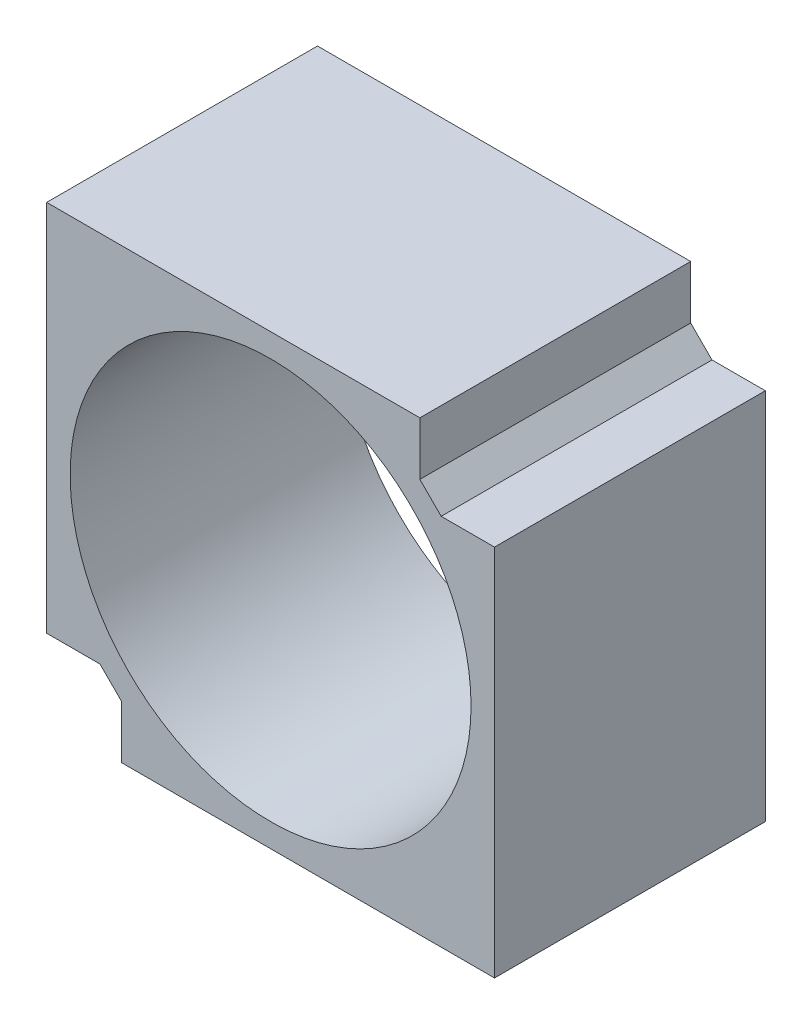
ISO-10303-21;
HEADER;
FILE_DESCRIPTION(('STEP AP214'),'2;1');
FILE_NAME('part.step','',(''),(''),'','','');
FILE_SCHEMA(('AUTOMOTIVE_DESIGN { 1 0 10303 214 1 1 1 1 }'));
ENDSEC;
DATA;
#1=APPLICATION_CONTEXT('core data for automotive mechanical design processes');
#2=APPLICATION_PROTOCOL_DEFINITION('international standard','automotive_design',2000,#1);
#3=PRODUCT_CONTEXT('',#1,'mechanical');
#4=PRODUCT('Part','Part','',(#3));
#5=PRODUCT_RELATED_PRODUCT_CATEGORY('part','',(#4));
#6=PRODUCT_DEFINITION_FORMATION('','',#4);
#7=PRODUCT_DEFINITION_CONTEXT('part definition',#1,'design');
#8=PRODUCT_DEFINITION('design','',#6,#7);
#9=PRODUCT_DEFINITION_SHAPE('','',#8);
#10=(LENGTH_UNIT() NAMED_UNIT(*) SI_UNIT(.MILLI.,.METRE.));
#11=(NAMED_UNIT(*) PLANE_ANGLE_UNIT() SI_UNIT($,.RADIAN.));
#12=(NAMED_UNIT(*) SI_UNIT($,.STERADIAN.) SOLID_ANGLE_UNIT());
#13=UNCERTAINTY_MEASURE_WITH_UNIT(LENGTH_MEASURE(1.E-05),#10,'distance_accuracy_value','');
#14=(GEOMETRIC_REPRESENTATION_CONTEXT(3) GLOBAL_UNCERTAINTY_ASSIGNED_CONTEXT((#13)) GLOBAL_UNIT_ASSIGNED_CONTEXT((#10,
#11,#12)) REPRESENTATION_CONTEXT('',''));
#15=CARTESIAN_POINT('',(0.,0.,0.));
#16=DIRECTION('',(0.,0.,1.));
#17=DIRECTION('',(1.,0.,0.));
#18=AXIS2_PLACEMENT_3D('',#15,#16,#17);
#19=CARTESIAN_POINT('',(-21.,-21.,25.4));
#20=DIRECTION('',(1.,0.,0.));
#21=DIRECTION('',(0.,0.,-1.));
#22=AXIS2_PLACEMENT_3D('',#19,#20,#21);
#23=PLANE('',#22);
#24=DIRECTION('',(0.,-1.,0.));
#25=VECTOR('',#24,1.);
#26=CARTESIAN_POINT('',(-21.,-21.,0.));
#27=LINE('',#26,#25);
#28=CARTESIAN_POINT('',(-21.,21.,0.));
#29=VERTEX_POINT('',#28);
#30=CARTESIAN_POINT('',(-21.,-14.,0.));
#31=VERTEX_POINT('',#30);
#32=EDGE_CURVE('E141',#29,#31,#27,.T.);
#33=ORIENTED_EDGE('',*,*,#32,.T.);
#34=DIRECTION('',(0.,0.,1.));
#35=VECTOR('',#34,1.);
#36=CARTESIAN_POINT('',(-21.,-14.,0.));
#37=LINE('',#36,#35);
#38=CARTESIAN_POINT('',(-21.,-14.,25.4));
#39=VERTEX_POINT('',#38);
#40=EDGE_CURVE('E181',#31,#39,#37,.T.);
#41=ORIENTED_EDGE('',*,*,#40,.T.);
#42=DIRECTION('',(0.,-1.,0.));
#43=VECTOR('',#42,1.);
#44=CARTESIAN_POINT('',(-21.,-21.,25.4));
#45=LINE('',#44,#43);
#46=CARTESIAN_POINT('',(-21.,21.,25.4));
#47=VERTEX_POINT('',#46);
#48=EDGE_CURVE('E157',#47,#39,#45,.T.);
#49=ORIENTED_EDGE('',*,*,#48,.F.);
#50=DIRECTION('',(0.,0.,-1.));
#51=VECTOR('',#50,1.);
#52=CARTESIAN_POINT('',(-21.,21.,25.4));
#53=LINE('',#52,#51);
#54=EDGE_CURVE('E11',#47,#29,#53,.T.);
#55=ORIENTED_EDGE('',*,*,#54,.T.);
#56=EDGE_LOOP('',(#33,#41,#49,#55));
#57=FACE_BOUND('',#56,.T.);
#58=ADVANCED_FACE('F40',(#57),#23,.F.);
#59=CARTESIAN_POINT('',(21.,-21.,25.4));
#60=DIRECTION('',(0.,1.,0.));
#61=DIRECTION('',(-1.,0.,0.));
#62=AXIS2_PLACEMENT_3D('',#59,#60,#61);
#63=PLANE('',#62);
#64=DIRECTION('',(1.,0.,0.));
#65=VECTOR('',#64,1.);
#66=CARTESIAN_POINT('',(21.,-21.,25.4));
#67=LINE('',#66,#65);
#68=CARTESIAN_POINT('',(-14.,-21.,25.4));
#69=VERTEX_POINT('',#68);
#70=CARTESIAN_POINT('',(21.,-21.,25.4));
#71=VERTEX_POINT('',#70);
#72=EDGE_CURVE('E132',#69,#71,#67,.T.);
#73=ORIENTED_EDGE('',*,*,#72,.F.);
#74=DIRECTION('',(0.,0.,1.));
#75=VECTOR('',#74,1.);
#76=CARTESIAN_POINT('',(-14.,-21.,0.));
#77=LINE('',#76,#75);
#78=CARTESIAN_POINT('',(-14.,-21.,0.));
#79=VERTEX_POINT('',#78);
#80=EDGE_CURVE('E119',#79,#69,#77,.T.);
#81=ORIENTED_EDGE('',*,*,#80,.F.);
#82=DIRECTION('',(1.,0.,0.));
#83=VECTOR('',#82,1.);
#84=CARTESIAN_POINT('',(21.,-21.,0.));
#85=LINE('',#84,#83);
#86=CARTESIAN_POINT('',(21.,-21.,0.));
#87=VERTEX_POINT('',#86);
#88=EDGE_CURVE('E130',#79,#87,#85,.T.);
#89=ORIENTED_EDGE('',*,*,#88,.T.);
#90=DIRECTION('',(0.,0.,-1.));
#91=VECTOR('',#90,1.);
#92=CARTESIAN_POINT('',(21.,-21.,25.4));
#93=LINE('',#92,#91);
#94=EDGE_CURVE('E47',#71,#87,#93,.T.);
#95=ORIENTED_EDGE('',*,*,#94,.F.);
#96=EDGE_LOOP('',(#73,#81,#89,#95));
#97=FACE_BOUND('',#96,.T.);
#98=ADVANCED_FACE('F128',(#97),#63,.F.);
#99=CARTESIAN_POINT('',(21.,21.,25.4));
#100=DIRECTION('',(-1.,0.,0.));
#101=DIRECTION('',(0.,-1.,0.));
#102=AXIS2_PLACEMENT_3D('',#99,#100,#101);
#103=PLANE('',#102);
#104=DIRECTION('',(0.,1.,0.));
#105=VECTOR('',#104,1.);
#106=CARTESIAN_POINT('',(21.,21.,0.));
#107=LINE('',#106,#105);
#108=CARTESIAN_POINT('',(21.,14.,0.));
#109=VERTEX_POINT('',#108);
#110=EDGE_CURVE('E140',#87,#109,#107,.T.);
#111=ORIENTED_EDGE('',*,*,#110,.T.);
#112=DIRECTION('',(0.,0.,1.));
#113=VECTOR('',#112,1.);
#114=CARTESIAN_POINT('',(21.,14.,0.));
#115=LINE('',#114,#113);
#116=CARTESIAN_POINT('',(21.,14.,25.4));
#117=VERTEX_POINT('',#116);
#118=EDGE_CURVE('E146',#109,#117,#115,.T.);
#119=ORIENTED_EDGE('',*,*,#118,.T.);
#120=DIRECTION('',(0.,1.,0.));
#121=VECTOR('',#120,1.);
#122=CARTESIAN_POINT('',(21.,21.,25.4));
#123=LINE('',#122,#121);
#124=EDGE_CURVE('E151',#71,#117,#123,.T.);
#125=ORIENTED_EDGE('',*,*,#124,.F.);
#126=ORIENTED_EDGE('',*,*,#94,.T.);
#127=EDGE_LOOP('',(#111,#119,#125,#126));
#128=FACE_BOUND('',#127,.T.);
#129=ADVANCED_FACE('F232',(#128),#103,.F.);
#130=CARTESIAN_POINT('',(0.,21.,25.4));
#131=DIRECTION('',(0.,-1.,0.));
#132=DIRECTION('',(0.,0.,-1.));
#133=AXIS2_PLACEMENT_3D('',#130,#131,#132);
#134=PLANE('',#133);
#135=DIRECTION('',(-1.,0.,0.));
#136=VECTOR('',#135,1.);
#137=CARTESIAN_POINT('',(-21.,21.,25.4));
#138=LINE('',#137,#136);
#139=CARTESIAN_POINT('',(14.,21.,25.4));
#140=VERTEX_POINT('',#139);
#141=EDGE_CURVE('E150',#140,#47,#138,.T.);
#142=ORIENTED_EDGE('',*,*,#141,.F.);
#143=DIRECTION('',(0.,0.,1.));
#144=VECTOR('',#143,1.);
#145=CARTESIAN_POINT('',(14.,21.,0.));
#146=LINE('',#145,#144);
#147=CARTESIAN_POINT('',(14.,21.,0.));
#148=VERTEX_POINT('',#147);
#149=EDGE_CURVE('E163',#148,#140,#146,.T.);
#150=ORIENTED_EDGE('',*,*,#149,.F.);
#151=DIRECTION('',(-1.,0.,0.));
#152=VECTOR('',#151,1.);
#153=CARTESIAN_POINT('',(0.,21.,0.));
#154=LINE('',#153,#152);
#155=EDGE_CURVE('E143',#148,#29,#154,.T.);
#156=ORIENTED_EDGE('',*,*,#155,.T.);
#157=ORIENTED_EDGE('',*,*,#54,.F.);
#158=EDGE_LOOP('',(#142,#150,#156,#157));
#159=FACE_BOUND('',#158,.T.);
#160=ADVANCED_FACE('F215',(#159),#134,.F.);
#161=CARTESIAN_POINT('',(0.,0.,25.4));
#162=DIRECTION('',(0.,0.,-1.));
#163=DIRECTION('',(-1.,0.,0.));
#164=AXIS2_PLACEMENT_3D('',#161,#162,#163);
#165=PLANE('',#164);
#166=CARTESIAN_POINT('',(0.,0.,25.4));
#167=DIRECTION('',(0.,0.,1.));
#168=DIRECTION('',(1.,0.,0.));
#169=AXIS2_PLACEMENT_3D('',#166,#167,#168);
#170=CIRCLE('',#169,18.8);
#171=CARTESIAN_POINT('',(18.8,0.,25.4));
#172=VERTEX_POINT('',#171);
#173=EDGE_CURVE('E200',#172,#172,#170,.T.);
#174=ORIENTED_EDGE('',*,*,#173,.F.);
#175=EDGE_LOOP('',(#174));
#176=FACE_BOUND('',#175,.T.);
#177=ORIENTED_EDGE('',*,*,#48,.T.);
#178=DIRECTION('',(-1.,0.,0.));
#179=VECTOR('',#178,1.);
#180=CARTESIAN_POINT('',(-16.,-14.,25.4));
#181=LINE('',#180,#179);
#182=CARTESIAN_POINT('',(-16.,-14.,25.4));
#183=VERTEX_POINT('',#182);
#184=EDGE_CURVE('E124',#183,#39,#181,.T.);
#185=ORIENTED_EDGE('',*,*,#184,.F.);
#186=DIRECTION('',(-0.707106781186548,0.707106781186547,0.));
#187=VECTOR('',#186,1.);
#188=CARTESIAN_POINT('',(-14.,-16.,25.4));
#189=LINE('',#188,#187);
#190=CARTESIAN_POINT('',(-14.,-16.,25.4));
#191=VERTEX_POINT('',#190);
#192=EDGE_CURVE('E192',#191,#183,#189,.T.);
#193=ORIENTED_EDGE('',*,*,#192,.F.);
#194=DIRECTION('',(0.,1.,0.));
#195=VECTOR('',#194,1.);
#196=CARTESIAN_POINT('',(-14.,-21.,25.4));
#197=LINE('',#196,#195);
#198=EDGE_CURVE('E195',#69,#191,#197,.T.);
#199=ORIENTED_EDGE('',*,*,#198,.F.);
#200=ORIENTED_EDGE('',*,*,#72,.T.);
#201=ORIENTED_EDGE('',*,*,#124,.T.);
#202=DIRECTION('',(1.,0.,0.));
#203=VECTOR('',#202,1.);
#204=CARTESIAN_POINT('',(21.,14.,25.4));
#205=LINE('',#204,#203);
#206=CARTESIAN_POINT('',(16.,14.,25.4));
#207=VERTEX_POINT('',#206);
#208=EDGE_CURVE('E172',#207,#117,#205,.T.);
#209=ORIENTED_EDGE('',*,*,#208,.F.);
#210=DIRECTION('',(0.707106781186548,-0.707106781186548,0.));
#211=VECTOR('',#210,1.);
#212=CARTESIAN_POINT('',(16.,14.,25.4));
#213=LINE('',#212,#211);
#214=CARTESIAN_POINT('',(14.,16.,25.4));
#215=VERTEX_POINT('',#214);
#216=EDGE_CURVE('E175',#215,#207,#213,.T.);
#217=ORIENTED_EDGE('',*,*,#216,.F.);
#218=DIRECTION('',(0.,-1.,0.));
#219=VECTOR('',#218,1.);
#220=CARTESIAN_POINT('',(14.,16.,25.4));
#221=LINE('',#220,#219);
#222=EDGE_CURVE('E178',#140,#215,#221,.T.);
#223=ORIENTED_EDGE('',*,*,#222,.F.);
#224=ORIENTED_EDGE('',*,*,#141,.T.);
#225=EDGE_LOOP('',(#177,#185,#193,#199,#200,#201,#209,#217,#223,#224));
#226=FACE_BOUND('',#225,.T.);
#227=ADVANCED_FACE('F213',(#176,#226),#165,.F.);
#228=CARTESIAN_POINT('',(0.,0.,0.));
#229=DIRECTION('',(0.,0.,-1.));
#230=DIRECTION('',(-1.,0.,0.));
#231=AXIS2_PLACEMENT_3D('',#228,#229,#230);
#232=PLANE('',#231);
#233=CARTESIAN_POINT('',(0.,0.,0.));
#234=DIRECTION('',(0.,0.,1.));
#235=DIRECTION('',(1.,0.,0.));
#236=AXIS2_PLACEMENT_3D('',#233,#234,#235);
#237=CIRCLE('',#236,18.8);
#238=CARTESIAN_POINT('',(18.8,0.,0.));
#239=VERTEX_POINT('',#238);
#240=EDGE_CURVE('E197',#239,#239,#237,.T.);
#241=ORIENTED_EDGE('',*,*,#240,.T.);
#242=EDGE_LOOP('',(#241));
#243=FACE_BOUND('',#242,.T.);
#244=DIRECTION('',(-1.,0.,0.));
#245=VECTOR('',#244,1.);
#246=CARTESIAN_POINT('',(-16.,-14.,0.));
#247=LINE('',#246,#245);
#248=CARTESIAN_POINT('',(-16.,-14.,0.));
#249=VERTEX_POINT('',#248);
#250=EDGE_CURVE('E133',#249,#31,#247,.T.);
#251=ORIENTED_EDGE('',*,*,#250,.T.);
#252=ORIENTED_EDGE('',*,*,#32,.F.);
#253=ORIENTED_EDGE('',*,*,#155,.F.);
#254=DIRECTION('',(0.,-1.,0.));
#255=VECTOR('',#254,1.);
#256=CARTESIAN_POINT('',(14.,16.,0.));
#257=LINE('',#256,#255);
#258=CARTESIAN_POINT('',(14.,16.,0.));
#259=VERTEX_POINT('',#258);
#260=EDGE_CURVE('E174',#148,#259,#257,.T.);
#261=ORIENTED_EDGE('',*,*,#260,.T.);
#262=DIRECTION('',(0.707106781186548,-0.707106781186548,0.));
#263=VECTOR('',#262,1.);
#264=CARTESIAN_POINT('',(16.,14.,0.));
#265=LINE('',#264,#263);
#266=CARTESIAN_POINT('',(16.,14.,0.));
#267=VERTEX_POINT('',#266);
#268=EDGE_CURVE('E62',#259,#267,#265,.T.);
#269=ORIENTED_EDGE('',*,*,#268,.T.);
#270=DIRECTION('',(1.,0.,0.));
#271=VECTOR('',#270,1.);
#272=CARTESIAN_POINT('',(21.,14.,0.));
#273=LINE('',#272,#271);
#274=EDGE_CURVE('E166',#267,#109,#273,.T.);
#275=ORIENTED_EDGE('',*,*,#274,.T.);
#276=ORIENTED_EDGE('',*,*,#110,.F.);
#277=ORIENTED_EDGE('',*,*,#88,.F.);
#278=DIRECTION('',(0.,1.,0.));
#279=VECTOR('',#278,1.);
#280=CARTESIAN_POINT('',(-14.,-21.,0.));
#281=LINE('',#280,#279);
#282=CARTESIAN_POINT('',(-14.,-16.,0.));
#283=VERTEX_POINT('',#282);
#284=EDGE_CURVE('E115',#79,#283,#281,.T.);
#285=ORIENTED_EDGE('',*,*,#284,.T.);
#286=DIRECTION('',(-0.707106781186548,0.707106781186547,0.));
#287=VECTOR('',#286,1.);
#288=CARTESIAN_POINT('',(-14.,-16.,0.));
#289=LINE('',#288,#287);
#290=EDGE_CURVE('E54',#283,#249,#289,.T.);
#291=ORIENTED_EDGE('',*,*,#290,.T.);
#292=EDGE_LOOP('',(#251,#252,#253,#261,#269,#275,#276,#277,#285,#291));
#293=FACE_BOUND('',#292,.T.);
#294=ADVANCED_FACE('F137',(#243,#293),#232,.T.);
#295=CARTESIAN_POINT('',(21.,14.,0.));
#296=DIRECTION('',(0.,-1.,0.));
#297=DIRECTION('',(0.,0.,-1.));
#298=AXIS2_PLACEMENT_3D('',#295,#296,#297);
#299=PLANE('',#298);
#300=ORIENTED_EDGE('',*,*,#208,.T.);
#301=ORIENTED_EDGE('',*,*,#118,.F.);
#302=ORIENTED_EDGE('',*,*,#274,.F.);
#303=DIRECTION('',(0.,0.,1.));
#304=VECTOR('',#303,1.);
#305=CARTESIAN_POINT('',(16.,14.,0.));
#306=LINE('',#305,#304);
#307=EDGE_CURVE('E168',#267,#207,#306,.T.);
#308=ORIENTED_EDGE('',*,*,#307,.T.);
#309=EDGE_LOOP('',(#300,#301,#302,#308));
#310=FACE_BOUND('',#309,.T.);
#311=ADVANCED_FACE('F235',(#310),#299,.F.);
#312=CARTESIAN_POINT('',(16.,14.,0.));
#313=DIRECTION('',(-0.707106781186548,-0.707106781186548,0.));
#314=DIRECTION('',(0.707106781186548,-0.707106781186548,0.));
#315=AXIS2_PLACEMENT_3D('',#312,#313,#314);
#316=PLANE('',#315);
#317=ORIENTED_EDGE('',*,*,#216,.T.);
#318=ORIENTED_EDGE('',*,*,#307,.F.);
#319=ORIENTED_EDGE('',*,*,#268,.F.);
#320=DIRECTION('',(0.,0.,1.));
#321=VECTOR('',#320,1.);
#322=CARTESIAN_POINT('',(14.,16.,0.));
#323=LINE('',#322,#321);
#324=EDGE_CURVE('E165',#259,#215,#323,.T.);
#325=ORIENTED_EDGE('',*,*,#324,.T.);
#326=EDGE_LOOP('',(#317,#318,#319,#325));
#327=FACE_BOUND('',#326,.T.);
#328=ADVANCED_FACE('F239',(#327),#316,.F.);
#329=CARTESIAN_POINT('',(14.,16.,0.));
#330=DIRECTION('',(-1.,0.,0.));
#331=DIRECTION('',(0.,-1.,0.));
#332=AXIS2_PLACEMENT_3D('',#329,#330,#331);
#333=PLANE('',#332);
#334=ORIENTED_EDGE('',*,*,#222,.T.);
#335=ORIENTED_EDGE('',*,*,#324,.F.);
#336=ORIENTED_EDGE('',*,*,#260,.F.);
#337=ORIENTED_EDGE('',*,*,#149,.T.);
#338=EDGE_LOOP('',(#334,#335,#336,#337));
#339=FACE_BOUND('',#338,.T.);
#340=ADVANCED_FACE('F237',(#339),#333,.F.);
#341=CARTESIAN_POINT('',(-16.,-14.,0.));
#342=DIRECTION('',(0.,1.,0.));
#343=DIRECTION('',(-1.,0.,0.));
#344=AXIS2_PLACEMENT_3D('',#341,#342,#343);
#345=PLANE('',#344);
#346=ORIENTED_EDGE('',*,*,#184,.T.);
#347=ORIENTED_EDGE('',*,*,#40,.F.);
#348=ORIENTED_EDGE('',*,*,#250,.F.);
#349=DIRECTION('',(0.,0.,1.));
#350=VECTOR('',#349,1.);
#351=CARTESIAN_POINT('',(-16.,-14.,0.));
#352=LINE('',#351,#350);
#353=EDGE_CURVE('E187',#249,#183,#352,.T.);
#354=ORIENTED_EDGE('',*,*,#353,.T.);
#355=EDGE_LOOP('',(#346,#347,#348,#354));
#356=FACE_BOUND('',#355,.T.);
#357=ADVANCED_FACE('F230',(#356),#345,.F.);
#358=CARTESIAN_POINT('',(-14.,-16.,0.));
#359=DIRECTION('',(0.707106781186547,0.707106781186548,0.));
#360=DIRECTION('',(-0.707106781186548,0.707106781186547,0.));
#361=AXIS2_PLACEMENT_3D('',#358,#359,#360);
#362=PLANE('',#361);
#363=ORIENTED_EDGE('',*,*,#192,.T.);
#364=ORIENTED_EDGE('',*,*,#353,.F.);
#365=ORIENTED_EDGE('',*,*,#290,.F.);
#366=DIRECTION('',(0.,0.,1.));
#367=VECTOR('',#366,1.);
#368=CARTESIAN_POINT('',(-14.,-16.,0.));
#369=LINE('',#368,#367);
#370=EDGE_CURVE('E121',#283,#191,#369,.T.);
#371=ORIENTED_EDGE('',*,*,#370,.T.);
#372=EDGE_LOOP('',(#363,#364,#365,#371));
#373=FACE_BOUND('',#372,.T.);
#374=ADVANCED_FACE('F231',(#373),#362,.F.);
#375=CARTESIAN_POINT('',(-14.,-21.,0.));
#376=DIRECTION('',(1.,0.,0.));
#377=DIRECTION('',(0.,0.,-1.));
#378=AXIS2_PLACEMENT_3D('',#375,#376,#377);
#379=PLANE('',#378);
#380=ORIENTED_EDGE('',*,*,#198,.T.);
#381=ORIENTED_EDGE('',*,*,#370,.F.);
#382=ORIENTED_EDGE('',*,*,#284,.F.);
#383=ORIENTED_EDGE('',*,*,#80,.T.);
#384=EDGE_LOOP('',(#380,#381,#382,#383));
#385=FACE_BOUND('',#384,.T.);
#386=ADVANCED_FACE('F118',(#385),#379,.F.);
#387=CARTESIAN_POINT('',(0.,0.,0.));
#388=DIRECTION('',(0.,0.,1.));
#389=DIRECTION('',(1.,0.,0.));
#390=AXIS2_PLACEMENT_3D('',#387,#388,#389);
#391=CYLINDRICAL_SURFACE('',#390,18.8);
#392=ORIENTED_EDGE('',*,*,#240,.F.);
#393=EDGE_LOOP('',(#392));
#394=FACE_BOUND('',#393,.T.);
#395=ORIENTED_EDGE('',*,*,#173,.T.);
#396=EDGE_LOOP('',(#395));
#397=FACE_BOUND('',#396,.T.);
#398=ADVANCED_FACE('F207',(#394,#397),#391,.F.);
#399=CLOSED_SHELL('',(#58,#98,#129,#160,#227,#294,#311,#328,#340,#357,#374,#386,#398));
#400=MANIFOLD_SOLID_BREP('B2',#399);
#401=ADVANCED_BREP_SHAPE_REPRESENTATION('',(#18,#400),#14);
#402=SHAPE_DEFINITION_REPRESENTATION(#9,#401);
ENDSEC;
END-ISO-10303-21;
